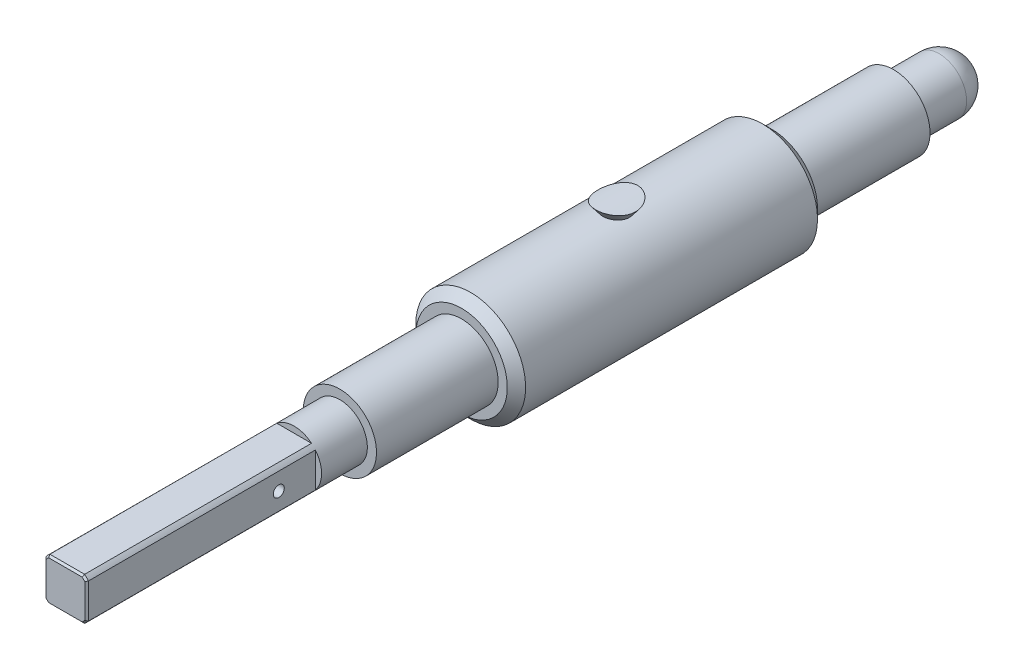
ISO-10303-21;
HEADER;
FILE_DESCRIPTION(('STEP AP214'),'2;1');
FILE_NAME('part.step','',(''),(''),'','','');
FILE_SCHEMA(('AUTOMOTIVE_DESIGN { 1 0 10303 214 1 1 1 1 }'));
ENDSEC;
DATA;
#1=APPLICATION_CONTEXT('core data for automotive mechanical design processes');
#2=APPLICATION_PROTOCOL_DEFINITION('international standard','automotive_design',2000,#1);
#3=PRODUCT_CONTEXT('',#1,'mechanical');
#4=PRODUCT('Part','Part','',(#3));
#5=PRODUCT_RELATED_PRODUCT_CATEGORY('part','',(#4));
#6=PRODUCT_DEFINITION_FORMATION('','',#4);
#7=PRODUCT_DEFINITION_CONTEXT('part definition',#1,'design');
#8=PRODUCT_DEFINITION('design','',#6,#7);
#9=PRODUCT_DEFINITION_SHAPE('','',#8);
#10=(LENGTH_UNIT() NAMED_UNIT(*) SI_UNIT(.MILLI.,.METRE.));
#11=(NAMED_UNIT(*) PLANE_ANGLE_UNIT() SI_UNIT($,.RADIAN.));
#12=(NAMED_UNIT(*) SI_UNIT($,.STERADIAN.) SOLID_ANGLE_UNIT());
#13=UNCERTAINTY_MEASURE_WITH_UNIT(LENGTH_MEASURE(1.E-05),#10,'distance_accuracy_value','');
#14=(GEOMETRIC_REPRESENTATION_CONTEXT(3) GLOBAL_UNCERTAINTY_ASSIGNED_CONTEXT((#13)) GLOBAL_UNIT_ASSIGNED_CONTEXT((#10,
#11,#12)) REPRESENTATION_CONTEXT('',''));
#15=CARTESIAN_POINT('',(0.,0.,0.));
#16=DIRECTION('',(0.,0.,1.));
#17=DIRECTION('',(1.,0.,0.));
#18=AXIS2_PLACEMENT_3D('',#15,#16,#17);
#19=CARTESIAN_POINT('',(0.,-108.5,-65.5));
#20=DIRECTION('',(0.,0.,-1.));
#21=DIRECTION('',(-1.,0.,0.));
#22=AXIS2_PLACEMENT_3D('',#19,#20,#21);
#23=CYLINDRICAL_SURFACE('',#22,5.99999999999999);
#24=CARTESIAN_POINT('',(0.,-108.5,-46.2));
#25=DIRECTION('',(0.,0.,1.));
#26=DIRECTION('',(1.,0.,0.));
#27=AXIS2_PLACEMENT_3D('',#24,#25,#26);
#28=CIRCLE('',#27,5.99999999999999);
#29=CARTESIAN_POINT('',(5.99999999999999,-108.5,-46.2));
#30=VERTEX_POINT('',#29);
#31=EDGE_CURVE('E220',#30,#30,#28,.T.);
#32=ORIENTED_EDGE('',*,*,#31,.T.);
#33=EDGE_LOOP('',(#32));
#34=FACE_BOUND('',#33,.T.);
#35=CARTESIAN_POINT('',(0.,-108.5,-14.3));
#36=DIRECTION('',(0.,0.,-1.));
#37=DIRECTION('',(-1.,0.,0.));
#38=AXIS2_PLACEMENT_3D('',#35,#36,#37);
#39=CIRCLE('',#38,5.99999999999999);
#40=CARTESIAN_POINT('',(-5.99999999999999,-108.5,-14.3));
#41=VERTEX_POINT('',#40);
#42=EDGE_CURVE('E284',#41,#41,#39,.T.);
#43=ORIENTED_EDGE('',*,*,#42,.T.);
#44=EDGE_LOOP('',(#43));
#45=FACE_BOUND('',#44,.T.);
#46=CARTESIAN_POINT('',(-0.82637820474592,-102.557180882551,-31.4907726388026));
#47=CARTESIAN_POINT('',(-0.88745278390253,-102.565673714073,-31.442263246116));
#48=CARTESIAN_POINT('',(-0.944525193709329,-102.574571898779,-31.3887307084372));
#49=CARTESIAN_POINT('',(-1.04961089123308,-102.592278845168,-31.2733383738218));
#50=CARTESIAN_POINT('',(-1.09761204529484,-102.601087472374,-31.2114676104821));
#51=CARTESIAN_POINT('',(-1.18685551918393,-102.618368464541,-31.0764186630549));
#52=CARTESIAN_POINT('',(-1.22736698646508,-102.626771496805,-31.0027479014204));
#53=CARTESIAN_POINT('',(-1.29639767309498,-102.641621113598,-30.8498274009609));
#54=CARTESIAN_POINT('',(-1.32491659444847,-102.648067649511,-30.7705775235612));
#55=CARTESIAN_POINT('',(-1.37086663897318,-102.658654127998,-30.6035291754309));
#56=CARTESIAN_POINT('',(-1.38751561436713,-102.662629450214,-30.5155041042145));
#57=CARTESIAN_POINT('',(-1.40647609896515,-102.667168738239,-30.3378309364648));
#58=CARTESIAN_POINT('',(-1.40878523045451,-102.667732138312,-30.2481825732418));
#59=CARTESIAN_POINT('',(-1.39892903879036,-102.665359932576,-30.0681089716912));
#60=CARTESIAN_POINT('',(-1.38650316947336,-102.662361341542,-29.9776986709831));
#61=CARTESIAN_POINT('',(-1.34698562124341,-102.653117314475,-29.8003016242328));
#62=CARTESIAN_POINT('',(-1.31989242502994,-102.646871542531,-29.7133152333849));
#63=CARTESIAN_POINT('',(-1.25162599544786,-102.631895884138,-29.5454697738345));
#64=CARTESIAN_POINT('',(-1.21048024363986,-102.623170851752,-29.4645991192579));
#65=CARTESIAN_POINT('',(-1.11486338066509,-102.60428579393,-29.3113082366902));
#66=CARTESIAN_POINT('',(-1.06039227283579,-102.594125768854,-29.2388880065824));
#67=CARTESIAN_POINT('',(-0.941083201845459,-102.57396399216,-29.1071312825275));
#68=CARTESIAN_POINT('',(-0.876611968800397,-102.563966860161,-29.0474631863073));
#69=CARTESIAN_POINT('',(-0.737658889157939,-102.545106782895,-28.9409609310564));
#70=CARTESIAN_POINT('',(-0.663183487452894,-102.536243114546,-28.8941185679672));
#71=CARTESIAN_POINT('',(-0.512891805506087,-102.521525512226,-28.8188747513442));
#72=CARTESIAN_POINT('',(-0.437700183019511,-102.515482798018,-28.789265162978));
#73=CARTESIAN_POINT('',(-0.283006333943005,-102.506179163899,-28.7443439612554));
#74=CARTESIAN_POINT('',(-0.203507492786278,-102.502916092006,-28.7290212861913));
#75=CARTESIAN_POINT('',(-0.0505955429153818,-102.499772252239,-28.7142678934116));
#76=CARTESIAN_POINT('',(0.0226825027364362,-102.499600928561,-28.7134719009311));
#77=CARTESIAN_POINT('',(0.168256616551282,-102.50191824034,-28.7243329491502));
#78=CARTESIAN_POINT('',(0.240552859425564,-102.504406396093,-28.7359877440355));
#79=CARTESIAN_POINT('',(0.379936918101601,-102.51164616207,-28.7706550873727));
#80=CARTESIAN_POINT('',(0.447115615263432,-102.516328450556,-28.7933205178987));
#81=CARTESIAN_POINT('',(0.576922973149197,-102.527445348322,-28.8488943896099));
#82=CARTESIAN_POINT('',(0.639550819877732,-102.533880270117,-28.8818046577197));
#83=CARTESIAN_POINT('',(0.762148265627854,-102.548265460455,-28.9586944584824));
#84=CARTESIAN_POINT('',(0.821798218175558,-102.556278219899,-29.0031705233515));
#85=CARTESIAN_POINT('',(0.933512279650743,-102.57279573948,-29.1007148537477));
#86=CARTESIAN_POINT('',(0.985573513144855,-102.581300684415,-29.1537863601677));
#87=CARTESIAN_POINT('',(1.08577183289901,-102.598819881024,-29.2723518922424));
#88=CARTESIAN_POINT('',(1.13308904578969,-102.607807571901,-29.3385430612302));
#89=CARTESIAN_POINT('',(1.21692096063208,-102.624548102523,-29.4775858930471));
#90=CARTESIAN_POINT('',(1.25343179085615,-102.632300499226,-29.5504399308514));
#91=CARTESIAN_POINT('',(1.31744552164147,-102.646325998204,-29.7067540878266));
#92=CARTESIAN_POINT('',(1.34404603877912,-102.652440637395,-29.7905992267105));
#93=CARTESIAN_POINT('',(1.38358850130719,-102.661670015936,-29.9616100382681));
#94=CARTESIAN_POINT('',(1.39652819994176,-102.664784261812,-30.0487762547082));
#95=CARTESIAN_POINT('',(1.4086955451044,-102.667708718895,-30.2269023373845));
#96=CARTESIAN_POINT('',(1.40747583902601,-102.667411140414,-30.3178949082596));
#97=CARTESIAN_POINT('',(1.39025894114319,-102.663283819764,-30.4983962634066));
#98=CARTESIAN_POINT('',(1.37426032283703,-102.659453736629,-30.5879049035962));
#99=CARTESIAN_POINT('',(1.32770718717805,-102.648695616203,-30.7632404618323));
#100=CARTESIAN_POINT('',(1.29709636881104,-102.641755602696,-30.8490517275927));
#101=CARTESIAN_POINT('',(1.22187138536613,-102.625606098346,-31.0140991005353));
#102=CARTESIAN_POINT('',(1.17725590290179,-102.616396394015,-31.0933345882622));
#103=CARTESIAN_POINT('',(1.07569006355021,-102.596991057237,-31.2414878794554));
#104=CARTESIAN_POINT('',(1.01894649992018,-102.5868133726,-31.3105493562402));
#105=CARTESIAN_POINT('',(0.893879362320993,-102.566621841271,-31.4373119009342));
#106=CARTESIAN_POINT('',(0.825559996945611,-102.55660793648,-31.4950170812095));
#107=CARTESIAN_POINT('',(0.683696850524749,-102.538680116792,-31.5932902446544));
#108=CARTESIAN_POINT('',(0.610758695559436,-102.530673326923,-31.6347126241589));
#109=CARTESIAN_POINT('',(0.458269254269458,-102.517039055396,-31.7033201588382));
#110=CARTESIAN_POINT('',(0.378723913179516,-102.511409461875,-31.7305179560572));
#111=CARTESIAN_POINT('',(0.22387427472047,-102.503727585641,-31.7672194423107));
#112=CARTESIAN_POINT('',(0.148937289854291,-102.501374718525,-31.7782163114319));
#113=CARTESIAN_POINT('',(-0.0017391687966094,-102.499528118826,-31.7868663697102));
#114=CARTESIAN_POINT('',(-0.0774784237001038,-102.500033625483,-31.7845231093596));
#115=CARTESIAN_POINT('',(-0.222738568142433,-102.503721601243,-31.767174945591));
#116=CARTESIAN_POINT('',(-0.292358463000509,-102.506740281334,-31.7529445657775));
#117=CARTESIAN_POINT('',(-0.428230256940059,-102.514914594998,-31.7134805200632));
#118=CARTESIAN_POINT('',(-0.494484023249986,-102.520069028989,-31.6882530304586));
#119=CARTESIAN_POINT('',(-0.606043836841092,-102.530492097917,-31.635422601142));
#120=CARTESIAN_POINT('',(-0.652436399173812,-102.535407924918,-31.610001966419));
#121=CARTESIAN_POINT('',(-0.741955113558313,-102.545881057924,-31.554076992841));
#122=CARTESIAN_POINT('',(-0.785081560010341,-102.551438305999,-31.5235731129733));
#123=CARTESIAN_POINT('',(-0.82637820474592,-102.557180882551,-31.4907726388026));
#124=B_SPLINE_CURVE_WITH_KNOTS('',3,(#46,#47,#48,#49,#50,#51,#52,#53,#54,#55,#56,#57,#58,#59,
#60,#61,#62,#63,#64,#65,#66,#67,#68,#69,#70,#71,#72,#73,#74,#75,#76,#77,#78,#79,#80,#81,#82,#83,
#84,#85,#86,#87,#88,#89,#90,#91,#92,#93,#94,#95,#96,#97,#98,#99,#100,#101,#102,#103,#104,#105,
#106,#107,#108,#109,#110,#111,#112,#113,#114,#115,#116,#117,#118,#119,#120,#121,#122,#123),
.UNSPECIFIED.,.T.,.F.,(4,2,2,2,2,2,2,2,2,2,2,2,2,2,2,2,2,2,2,2,2,2,2,2,2,2,2,2,2,2,2,2,2,2,2,2,
2,2,4),(0.,0.235192707713775,0.470697814900819,0.72307958224305,0.975467620490893,
1.24324566640779,1.51106811188776,1.78369770707931,2.05635551055298,2.32848312157081,
2.6006106644316,2.86444091583586,3.12810201025082,3.36987338952953,3.61145742039754,
3.83020580952266,4.04891474850555,4.26113688835574,4.47339689470599,4.69697133824997,
4.92063027715513,5.16516582809959,5.40978888586117,5.67311900794847,5.93649243244573,
6.20820895113386,6.47995169939725,6.75275003298626,7.02557403577868,7.29407224857164,
7.5624730525879,7.81386141405137,8.0650259737544,8.29116117339579,8.51723618968281,
8.72963511210783,8.9419148985146,9.10095891372674,9.25998857596885),.UNSPECIFIED.);
#125=CARTESIAN_POINT('',(-0.82637820474592,-102.557180882551,-31.4907726388026));
#126=VERTEX_POINT('',#125);
#127=EDGE_CURVE('E223',#126,#126,#124,.T.);
#128=ORIENTED_EDGE('',*,*,#127,.F.);
#129=EDGE_LOOP('',(#128));
#130=FACE_BOUND('',#129,.T.);
#131=ADVANCED_FACE('F98',(#34,#45,#130),#23,.T.);
#132=CARTESIAN_POINT('',(0.,-108.5,-65.5));
#133=DIRECTION('',(0.,0.,-1.));
#134=DIRECTION('',(-1.,0.,0.));
#135=AXIS2_PLACEMENT_3D('',#132,#133,#134);
#136=CYLINDRICAL_SURFACE('',#135,3.00000000000001);
#137=CARTESIAN_POINT('',(0.,-108.5,0.));
#138=DIRECTION('',(0.,0.,-1.));
#139=DIRECTION('',(-1.,0.,0.));
#140=AXIS2_PLACEMENT_3D('',#137,#138,#139);
#141=CIRCLE('',#140,3.);
#142=CARTESIAN_POINT('',(-3.,-108.5,0.));
#143=VERTEX_POINT('',#142);
#144=EDGE_CURVE('E271',#143,#143,#141,.T.);
#145=ORIENTED_EDGE('',*,*,#144,.F.);
#146=EDGE_LOOP('',(#145));
#147=FACE_BOUND('',#146,.T.);
#148=DIRECTION('',(0.,0.,-1.));
#149=VECTOR('',#148,1.);
#150=CARTESIAN_POINT('',(-2.32132034355964,-106.599612707216,-65.5));
#151=LINE('',#150,#149);
#152=CARTESIAN_POINT('',(-2.32132034355964,-106.599612707216,29.8));
#153=VERTEX_POINT('',#152);
#154=CARTESIAN_POINT('',(-2.32132034355964,-106.599612707216,5.));
#155=VERTEX_POINT('',#154);
#156=EDGE_CURVE('E256',#153,#155,#151,.T.);
#157=ORIENTED_EDGE('',*,*,#156,.F.);
#158=CARTESIAN_POINT('',(0.,-108.5,29.8));
#159=DIRECTION('',(0.,0.,-1.));
#160=DIRECTION('',(-1.,0.,0.));
#161=AXIS2_PLACEMENT_3D('',#158,#159,#160);
#162=CIRCLE('',#161,3.00000000000001);
#163=CARTESIAN_POINT('',(-1.90038729278436,-106.17867965644,29.8));
#164=VERTEX_POINT('',#163);
#165=EDGE_CURVE('E246',#153,#164,#162,.T.);
#166=ORIENTED_EDGE('',*,*,#165,.T.);
#167=DIRECTION('',(0.,0.,-1.));
#168=VECTOR('',#167,1.);
#169=CARTESIAN_POINT('',(-1.90038729278436,-106.17867965644,-65.5));
#170=LINE('',#169,#168);
#171=CARTESIAN_POINT('',(-1.90038729278436,-106.17867965644,5.));
#172=VERTEX_POINT('',#171);
#173=EDGE_CURVE('E241',#172,#164,#170,.F.);
#174=ORIENTED_EDGE('',*,*,#173,.F.);
#175=CARTESIAN_POINT('',(0.,-108.5,5.));
#176=DIRECTION('',(0.,0.,1.));
#177=DIRECTION('',(1.,0.,0.));
#178=AXIS2_PLACEMENT_3D('',#175,#176,#177);
#179=CIRCLE('',#178,3.00000000000001);
#180=CARTESIAN_POINT('',(1.90038729278436,-106.17867965644,5.));
#181=VERTEX_POINT('',#180);
#182=EDGE_CURVE('E218',#181,#172,#179,.T.);
#183=ORIENTED_EDGE('',*,*,#182,.F.);
#184=DIRECTION('',(0.,0.,-1.));
#185=VECTOR('',#184,1.);
#186=CARTESIAN_POINT('',(1.90038729278436,-106.17867965644,-65.5));
#187=LINE('',#186,#185);
#188=CARTESIAN_POINT('',(1.90038729278436,-106.17867965644,29.8));
#189=VERTEX_POINT('',#188);
#190=EDGE_CURVE('E242',#189,#181,#187,.T.);
#191=ORIENTED_EDGE('',*,*,#190,.F.);
#192=CARTESIAN_POINT('',(0.,-108.5,29.8));
#193=DIRECTION('',(0.,0.,-1.));
#194=DIRECTION('',(-1.,0.,0.));
#195=AXIS2_PLACEMENT_3D('',#192,#193,#194);
#196=CIRCLE('',#195,3.00000000000001);
#197=CARTESIAN_POINT('',(2.32132034355964,-106.599612707216,29.8));
#198=VERTEX_POINT('',#197);
#199=EDGE_CURVE('E583',#189,#198,#196,.T.);
#200=ORIENTED_EDGE('',*,*,#199,.T.);
#201=DIRECTION('',(0.,0.,-1.));
#202=VECTOR('',#201,1.);
#203=CARTESIAN_POINT('',(2.32132034355964,-106.599612707216,-65.5));
#204=LINE('',#203,#202);
#205=CARTESIAN_POINT('',(2.32132034355964,-106.599612707216,5.));
#206=VERTEX_POINT('',#205);
#207=EDGE_CURVE('E203',#206,#198,#204,.F.);
#208=ORIENTED_EDGE('',*,*,#207,.F.);
#209=CARTESIAN_POINT('',(2.32132034355964,-110.400387292784,5.));
#210=VERTEX_POINT('',#209);
#211=EDGE_CURVE('E214',#210,#206,#179,.T.);
#212=ORIENTED_EDGE('',*,*,#211,.F.);
#213=DIRECTION('',(0.,0.,-1.));
#214=VECTOR('',#213,1.);
#215=CARTESIAN_POINT('',(2.32132034355964,-110.400387292784,-65.5));
#216=LINE('',#215,#214);
#217=CARTESIAN_POINT('',(2.32132034355964,-110.400387292784,29.8));
#218=VERTEX_POINT('',#217);
#219=EDGE_CURVE('E247',#218,#210,#216,.T.);
#220=ORIENTED_EDGE('',*,*,#219,.F.);
#221=CARTESIAN_POINT('',(0.,-108.5,29.8));
#222=DIRECTION('',(0.,0.,-1.));
#223=DIRECTION('',(-1.,0.,0.));
#224=AXIS2_PLACEMENT_3D('',#221,#222,#223);
#225=CIRCLE('',#224,3.00000000000001);
#226=CARTESIAN_POINT('',(1.90038729278431,-110.82132034356,29.8));
#227=VERTEX_POINT('',#226);
#228=EDGE_CURVE('E582',#218,#227,#225,.T.);
#229=ORIENTED_EDGE('',*,*,#228,.T.);
#230=DIRECTION('',(0.,0.,-1.));
#231=VECTOR('',#230,1.);
#232=CARTESIAN_POINT('',(1.90038729278431,-110.82132034356,-65.5));
#233=LINE('',#232,#231);
#234=CARTESIAN_POINT('',(1.90038729278431,-110.82132034356,5.));
#235=VERTEX_POINT('',#234);
#236=EDGE_CURVE('E204',#235,#227,#233,.F.);
#237=ORIENTED_EDGE('',*,*,#236,.F.);
#238=CARTESIAN_POINT('',(-1.90038729278431,-110.82132034356,5.));
#239=VERTEX_POINT('',#238);
#240=EDGE_CURVE('E208',#239,#235,#179,.T.);
#241=ORIENTED_EDGE('',*,*,#240,.F.);
#242=DIRECTION('',(0.,0.,-1.));
#243=VECTOR('',#242,1.);
#244=CARTESIAN_POINT('',(-1.90038729278431,-110.82132034356,-65.5));
#245=LINE('',#244,#243);
#246=CARTESIAN_POINT('',(-1.90038729278431,-110.82132034356,29.8));
#247=VERTEX_POINT('',#246);
#248=EDGE_CURVE('E193',#247,#239,#245,.T.);
#249=ORIENTED_EDGE('',*,*,#248,.F.);
#250=CARTESIAN_POINT('',(0.,-108.5,29.8));
#251=DIRECTION('',(0.,0.,-1.));
#252=DIRECTION('',(-1.,0.,0.));
#253=AXIS2_PLACEMENT_3D('',#250,#251,#252);
#254=CIRCLE('',#253,3.00000000000001);
#255=CARTESIAN_POINT('',(-2.32132034355964,-110.400387292784,29.8));
#256=VERTEX_POINT('',#255);
#257=EDGE_CURVE('E229',#247,#256,#254,.T.);
#258=ORIENTED_EDGE('',*,*,#257,.T.);
#259=DIRECTION('',(0.,0.,-1.));
#260=VECTOR('',#259,1.);
#261=CARTESIAN_POINT('',(-2.32132034355964,-110.400387292784,-65.5));
#262=LINE('',#261,#260);
#263=CARTESIAN_POINT('',(-2.32132034355964,-110.400387292784,5.));
#264=VERTEX_POINT('',#263);
#265=EDGE_CURVE('E249',#264,#256,#262,.F.);
#266=ORIENTED_EDGE('',*,*,#265,.F.);
#267=EDGE_CURVE('E217',#155,#264,#179,.T.);
#268=ORIENTED_EDGE('',*,*,#267,.F.);
#269=EDGE_LOOP('',(#157,#166,#174,#183,#191,#200,#208,#212,#220,#229,#237,#241,#249,#258,#266,#268));
#270=FACE_BOUND('',#269,.T.);
#271=ADVANCED_FACE('F213',(#147,#270),#136,.T.);
#272=CARTESIAN_POINT('',(0.,-108.5,30.));
#273=DIRECTION('',(0.,0.,-1.));
#274=DIRECTION('',(-1.,0.,0.));
#275=AXIS2_PLACEMENT_3D('',#272,#273,#274);
#276=PLANE('',#275);
#277=DIRECTION('',(-1.,0.,0.));
#278=VECTOR('',#277,1.);
#279=CARTESIAN_POINT('',(-1.90038729278437,-106.37867965644,30.));
#280=LINE('',#279,#278);
#281=CARTESIAN_POINT('',(1.82756668824975,-106.37867965644,30.));
#282=VERTEX_POINT('',#281);
#283=CARTESIAN_POINT('',(-1.82756668824974,-106.37867965644,30.));
#284=VERTEX_POINT('',#283);
#285=EDGE_CURVE('E120',#282,#284,#280,.T.);
#286=ORIENTED_EDGE('',*,*,#285,.T.);
#287=CARTESIAN_POINT('',(0.,-108.5,30.));
#288=DIRECTION('',(0.,0.,-1.));
#289=DIRECTION('',(-1.,0.,0.));
#290=AXIS2_PLACEMENT_3D('',#287,#288,#289);
#291=CIRCLE('',#290,2.8);
#292=CARTESIAN_POINT('',(-2.12132034355963,-106.67243331175,30.));
#293=VERTEX_POINT('',#292);
#294=EDGE_CURVE('E567',#284,#293,#291,.F.);
#295=ORIENTED_EDGE('',*,*,#294,.T.);
#296=DIRECTION('',(0.,-1.,0.));
#297=VECTOR('',#296,1.);
#298=CARTESIAN_POINT('',(-2.12132034355963,-110.400387292784,30.));
#299=LINE('',#298,#297);
#300=CARTESIAN_POINT('',(-2.12132034355963,-110.32756668825,30.));
#301=VERTEX_POINT('',#300);
#302=EDGE_CURVE('E560',#293,#301,#299,.T.);
#303=ORIENTED_EDGE('',*,*,#302,.T.);
#304=CARTESIAN_POINT('',(0.,-108.5,30.));
#305=DIRECTION('',(0.,0.,-1.));
#306=DIRECTION('',(-1.,0.,0.));
#307=AXIS2_PLACEMENT_3D('',#304,#305,#306);
#308=CIRCLE('',#307,2.8);
#309=CARTESIAN_POINT('',(-1.82756668824969,-110.62132034356,30.));
#310=VERTEX_POINT('',#309);
#311=EDGE_CURVE('E550',#301,#310,#308,.F.);
#312=ORIENTED_EDGE('',*,*,#311,.T.);
#313=DIRECTION('',(1.,0.,0.));
#314=VECTOR('',#313,1.);
#315=CARTESIAN_POINT('',(1.90038729278432,-110.62132034356,30.));
#316=LINE('',#315,#314);
#317=CARTESIAN_POINT('',(1.8275666882497,-110.62132034356,30.));
#318=VERTEX_POINT('',#317);
#319=EDGE_CURVE('E553',#310,#318,#316,.T.);
#320=ORIENTED_EDGE('',*,*,#319,.T.);
#321=CARTESIAN_POINT('',(0.,-108.5,30.));
#322=DIRECTION('',(0.,0.,-1.));
#323=DIRECTION('',(-1.,0.,0.));
#324=AXIS2_PLACEMENT_3D('',#321,#322,#323);
#325=CIRCLE('',#324,2.80000000000001);
#326=CARTESIAN_POINT('',(2.12132034355963,-110.32756668825,30.));
#327=VERTEX_POINT('',#326);
#328=EDGE_CURVE('E556',#318,#327,#325,.F.);
#329=ORIENTED_EDGE('',*,*,#328,.T.);
#330=DIRECTION('',(0.,1.,0.));
#331=VECTOR('',#330,1.);
#332=CARTESIAN_POINT('',(2.12132034355964,-106.599612707216,30.));
#333=LINE('',#332,#331);
#334=CARTESIAN_POINT('',(2.12132034355964,-106.67243331175,30.));
#335=VERTEX_POINT('',#334);
#336=EDGE_CURVE('E558',#327,#335,#333,.T.);
#337=ORIENTED_EDGE('',*,*,#336,.T.);
#338=CARTESIAN_POINT('',(0.,-108.5,30.));
#339=DIRECTION('',(0.,0.,-1.));
#340=DIRECTION('',(-1.,0.,0.));
#341=AXIS2_PLACEMENT_3D('',#338,#339,#340);
#342=CIRCLE('',#341,2.80000000000001);
#343=EDGE_CURVE('E125',#335,#282,#342,.F.);
#344=ORIENTED_EDGE('',*,*,#343,.T.);
#345=EDGE_LOOP('',(#286,#295,#303,#312,#320,#329,#337,#344));
#346=FACE_BOUND('',#345,.T.);
#347=ADVANCED_FACE('F305',(#346),#276,.F.);
#348=CARTESIAN_POINT('',(0.,-114.5,-47.2));
#349=DIRECTION('',(0.,0.,1.));
#350=DIRECTION('',(1.,0.,0.));
#351=AXIS2_PLACEMENT_3D('',#348,#349,#350);
#352=PLANE('',#351);
#353=CARTESIAN_POINT('',(0.,-108.5,-47.2));
#354=DIRECTION('',(0.,0.,1.));
#355=DIRECTION('',(1.,0.,0.));
#356=AXIS2_PLACEMENT_3D('',#353,#354,#355);
#357=CIRCLE('',#356,5.00000000000001);
#358=CARTESIAN_POINT('',(5.00000000000001,-108.5,-47.2));
#359=VERTEX_POINT('',#358);
#360=EDGE_CURVE('E280',#359,#359,#357,.F.);
#361=ORIENTED_EDGE('',*,*,#360,.T.);
#362=EDGE_LOOP('',(#361));
#363=FACE_BOUND('',#362,.T.);
#364=CARTESIAN_POINT('',(0.,-108.5,-47.2));
#365=DIRECTION('',(0.,0.,-1.));
#366=DIRECTION('',(-1.,0.,0.));
#367=AXIS2_PLACEMENT_3D('',#364,#365,#366);
#368=CIRCLE('',#367,4.);
#369=CARTESIAN_POINT('',(-4.,-108.5,-47.2));
#370=VERTEX_POINT('',#369);
#371=EDGE_CURVE('E258',#370,#370,#368,.T.);
#372=ORIENTED_EDGE('',*,*,#371,.F.);
#373=EDGE_LOOP('',(#372));
#374=FACE_BOUND('',#373,.T.);
#375=ADVANCED_FACE('F301',(#363,#374),#352,.F.);
#376=CARTESIAN_POINT('',(0.,-112.5,-13.3));
#377=DIRECTION('',(0.,0.,-1.));
#378=DIRECTION('',(-1.,0.,0.));
#379=AXIS2_PLACEMENT_3D('',#376,#377,#378);
#380=PLANE('',#379);
#381=CARTESIAN_POINT('',(0.,-108.5,-13.3));
#382=DIRECTION('',(0.,0.,-1.));
#383=DIRECTION('',(-1.,0.,0.));
#384=AXIS2_PLACEMENT_3D('',#381,#382,#383);
#385=CIRCLE('',#384,4.99999999999997);
#386=CARTESIAN_POINT('',(-4.99999999999997,-108.5,-13.3));
#387=VERTEX_POINT('',#386);
#388=EDGE_CURVE('E215',#387,#387,#385,.F.);
#389=ORIENTED_EDGE('',*,*,#388,.T.);
#390=EDGE_LOOP('',(#389));
#391=FACE_BOUND('',#390,.T.);
#392=CARTESIAN_POINT('',(0.,-108.5,-13.3));
#393=DIRECTION('',(0.,0.,-1.));
#394=DIRECTION('',(-1.,0.,0.));
#395=AXIS2_PLACEMENT_3D('',#392,#393,#394);
#396=CIRCLE('',#395,4.);
#397=CARTESIAN_POINT('',(-4.,-108.5,-13.3));
#398=VERTEX_POINT('',#397);
#399=EDGE_CURVE('E277',#398,#398,#396,.T.);
#400=ORIENTED_EDGE('',*,*,#399,.T.);
#401=EDGE_LOOP('',(#400));
#402=FACE_BOUND('',#401,.T.);
#403=ADVANCED_FACE('F304',(#391,#402),#380,.F.);
#404=CARTESIAN_POINT('',(0.,-108.5,-65.5));
#405=DIRECTION('',(0.,0.,-1.));
#406=DIRECTION('',(-1.,0.,0.));
#407=AXIS2_PLACEMENT_3D('',#404,#405,#406);
#408=CYLINDRICAL_SURFACE('',#407,4.);
#409=ORIENTED_EDGE('',*,*,#399,.F.);
#410=EDGE_LOOP('',(#409));
#411=FACE_BOUND('',#410,.T.);
#412=CARTESIAN_POINT('',(0.,-108.5,0.));
#413=DIRECTION('',(0.,0.,-1.));
#414=DIRECTION('',(-1.,0.,0.));
#415=AXIS2_PLACEMENT_3D('',#412,#413,#414);
#416=CIRCLE('',#415,4.);
#417=CARTESIAN_POINT('',(-4.,-108.5,0.));
#418=VERTEX_POINT('',#417);
#419=EDGE_CURVE('E274',#418,#418,#416,.T.);
#420=ORIENTED_EDGE('',*,*,#419,.T.);
#421=EDGE_LOOP('',(#420));
#422=FACE_BOUND('',#421,.T.);
#423=ADVANCED_FACE('F628',(#411,#422),#408,.T.);
#424=CARTESIAN_POINT('',(0.,-111.5,0.));
#425=DIRECTION('',(0.,0.,-1.));
#426=DIRECTION('',(-1.,0.,0.));
#427=AXIS2_PLACEMENT_3D('',#424,#425,#426);
#428=PLANE('',#427);
#429=ORIENTED_EDGE('',*,*,#419,.F.);
#430=EDGE_LOOP('',(#429));
#431=FACE_BOUND('',#430,.T.);
#432=ORIENTED_EDGE('',*,*,#144,.T.);
#433=EDGE_LOOP('',(#432));
#434=FACE_BOUND('',#433,.T.);
#435=ADVANCED_FACE('F623',(#431,#434),#428,.F.);
#436=CARTESIAN_POINT('',(0.,-108.5,-65.5));
#437=DIRECTION('',(0.,0.,1.));
#438=DIRECTION('',(1.,0.,0.));
#439=AXIS2_PLACEMENT_3D('',#436,#437,#438);
#440=SPHERICAL_SURFACE('',#439,3.);
#441=CARTESIAN_POINT('',(0.,-108.5,-65.5));
#442=DIRECTION('',(0.,0.,-1.));
#443=DIRECTION('',(-1.,0.,0.));
#444=AXIS2_PLACEMENT_3D('',#441,#442,#443);
#445=CIRCLE('',#444,3.);
#446=CARTESIAN_POINT('',(-3.,-108.5,-65.5));
#447=VERTEX_POINT('',#446);
#448=EDGE_CURVE('E270',#447,#447,#445,.T.);
#449=ORIENTED_EDGE('',*,*,#448,.T.);
#450=EDGE_LOOP('',(#449));
#451=FACE_BOUND('',#450,.T.);
#452=ADVANCED_FACE('F613',(#451),#440,.T.);
#453=CARTESIAN_POINT('',(0.,-108.5,-65.5));
#454=DIRECTION('',(0.,0.,-1.));
#455=DIRECTION('',(-1.,0.,0.));
#456=AXIS2_PLACEMENT_3D('',#453,#454,#455);
#457=CYLINDRICAL_SURFACE('',#456,3.);
#458=ORIENTED_EDGE('',*,*,#448,.F.);
#459=EDGE_LOOP('',(#458));
#460=FACE_BOUND('',#459,.T.);
#461=CARTESIAN_POINT('',(0.,-108.5,-60.5));
#462=DIRECTION('',(0.,0.,-1.));
#463=DIRECTION('',(-1.,0.,0.));
#464=AXIS2_PLACEMENT_3D('',#461,#462,#463);
#465=CIRCLE('',#464,3.);
#466=CARTESIAN_POINT('',(-3.,-108.5,-60.5));
#467=VERTEX_POINT('',#466);
#468=EDGE_CURVE('E266',#467,#467,#465,.T.);
#469=ORIENTED_EDGE('',*,*,#468,.T.);
#470=EDGE_LOOP('',(#469));
#471=FACE_BOUND('',#470,.T.);
#472=ADVANCED_FACE('F316',(#460,#471),#457,.T.);
#473=CARTESIAN_POINT('',(0.,-112.5,-60.5));
#474=DIRECTION('',(0.,0.,1.));
#475=DIRECTION('',(1.,0.,0.));
#476=AXIS2_PLACEMENT_3D('',#473,#474,#475);
#477=PLANE('',#476);
#478=ORIENTED_EDGE('',*,*,#468,.F.);
#479=EDGE_LOOP('',(#478));
#480=FACE_BOUND('',#479,.T.);
#481=CARTESIAN_POINT('',(0.,-108.5,-60.5));
#482=DIRECTION('',(0.,0.,-1.));
#483=DIRECTION('',(-1.,0.,0.));
#484=AXIS2_PLACEMENT_3D('',#481,#482,#483);
#485=CIRCLE('',#484,4.);
#486=CARTESIAN_POINT('',(-4.,-108.5,-60.5));
#487=VERTEX_POINT('',#486);
#488=EDGE_CURVE('E262',#487,#487,#485,.T.);
#489=ORIENTED_EDGE('',*,*,#488,.T.);
#490=EDGE_LOOP('',(#489));
#491=FACE_BOUND('',#490,.T.);
#492=ADVANCED_FACE('F310',(#480,#491),#477,.F.);
#493=CARTESIAN_POINT('',(0.,-108.5,-65.5));
#494=DIRECTION('',(0.,0.,-1.));
#495=DIRECTION('',(-1.,0.,0.));
#496=AXIS2_PLACEMENT_3D('',#493,#494,#495);
#497=CYLINDRICAL_SURFACE('',#496,4.);
#498=ORIENTED_EDGE('',*,*,#488,.F.);
#499=EDGE_LOOP('',(#498));
#500=FACE_BOUND('',#499,.T.);
#501=ORIENTED_EDGE('',*,*,#371,.T.);
#502=EDGE_LOOP('',(#501));
#503=FACE_BOUND('',#502,.T.);
#504=ADVANCED_FACE('F297',(#500,#503),#497,.T.);
#505=CARTESIAN_POINT('',(0.,-108.5,-47.2));
#506=DIRECTION('',(0.,0.,1.));
#507=DIRECTION('',(1.,0.,0.));
#508=AXIS2_PLACEMENT_3D('',#505,#506,#507);
#509=CONICAL_SURFACE('',#508,5.00000000000001,0.785398163397438);
#510=ORIENTED_EDGE('',*,*,#31,.F.);
#511=EDGE_LOOP('',(#510));
#512=FACE_BOUND('',#511,.T.);
#513=ORIENTED_EDGE('',*,*,#360,.F.);
#514=EDGE_LOOP('',(#513));
#515=FACE_BOUND('',#514,.T.);
#516=ADVANCED_FACE('F293',(#512,#515),#509,.T.);
#517=CARTESIAN_POINT('',(0.,-108.5,-14.3));
#518=DIRECTION('',(0.,0.,-1.));
#519=DIRECTION('',(-1.,0.,0.));
#520=AXIS2_PLACEMENT_3D('',#517,#518,#519);
#521=CONICAL_SURFACE('',#520,5.99999999999999,0.785398163397456);
#522=ORIENTED_EDGE('',*,*,#388,.F.);
#523=EDGE_LOOP('',(#522));
#524=FACE_BOUND('',#523,.T.);
#525=ORIENTED_EDGE('',*,*,#42,.F.);
#526=EDGE_LOOP('',(#525));
#527=FACE_BOUND('',#526,.T.);
#528=ADVANCED_FACE('F296',(#524,#527),#521,.T.);
#529=CARTESIAN_POINT('',(-2.32132034355964,-110.82132034356,5.));
#530=DIRECTION('',(0.,-1.,0.));
#531=DIRECTION('',(0.,0.,-1.));
#532=AXIS2_PLACEMENT_3D('',#529,#530,#531);
#533=PLANE('',#532);
#534=ORIENTED_EDGE('',*,*,#236,.T.);
#535=DIRECTION('',(-1.,0.,0.));
#536=VECTOR('',#535,1.);
#537=CARTESIAN_POINT('',(-1.90038729278432,-110.82132034356,29.8));
#538=LINE('',#537,#536);
#539=EDGE_CURVE('E112',#227,#247,#538,.T.);
#540=ORIENTED_EDGE('',*,*,#539,.T.);
#541=ORIENTED_EDGE('',*,*,#248,.T.);
#542=DIRECTION('',(1.,0.,0.));
#543=VECTOR('',#542,1.);
#544=CARTESIAN_POINT('',(-2.32132034355964,-110.82132034356,5.));
#545=LINE('',#544,#543);
#546=EDGE_CURVE('E197',#239,#235,#545,.T.);
#547=ORIENTED_EDGE('',*,*,#546,.T.);
#548=EDGE_LOOP('',(#534,#540,#541,#547));
#549=FACE_BOUND('',#548,.T.);
#550=ADVANCED_FACE('F196',(#549),#533,.T.);
#551=CARTESIAN_POINT('',(0.,-108.5,5.));
#552=DIRECTION('',(0.,0.,1.));
#553=DIRECTION('',(1.,0.,0.));
#554=AXIS2_PLACEMENT_3D('',#551,#552,#553);
#555=PLANE('',#554);
#556=ORIENTED_EDGE('',*,*,#240,.T.);
#557=ORIENTED_EDGE('',*,*,#546,.F.);
#558=EDGE_LOOP('',(#556,#557));
#559=FACE_BOUND('',#558,.T.);
#560=ADVANCED_FACE('F207',(#559),#555,.T.);
#561=CARTESIAN_POINT('',(2.32132034355964,-106.17867965644,5.));
#562=DIRECTION('',(1.,0.,0.));
#563=DIRECTION('',(0.,1.,0.));
#564=AXIS2_PLACEMENT_3D('',#561,#562,#563);
#565=PLANE('',#564);
#566=CARTESIAN_POINT('',(2.32132034355964,-108.5,9.));
#567=DIRECTION('',(1.,0.,0.));
#568=DIRECTION('',(0.,1.,0.));
#569=AXIS2_PLACEMENT_3D('',#566,#567,#568);
#570=CIRCLE('',#569,0.600000000000008);
#571=CARTESIAN_POINT('',(2.32132034355964,-107.9,9.));
#572=VERTEX_POINT('',#571);
#573=EDGE_CURVE('E596',#572,#572,#570,.T.);
#574=ORIENTED_EDGE('',*,*,#573,.F.);
#575=EDGE_LOOP('',(#574));
#576=FACE_BOUND('',#575,.T.);
#577=ORIENTED_EDGE('',*,*,#207,.T.);
#578=DIRECTION('',(0.,-1.,0.));
#579=VECTOR('',#578,1.);
#580=CARTESIAN_POINT('',(2.32132034355964,-110.400387292784,29.8));
#581=LINE('',#580,#579);
#582=EDGE_CURVE('E571',#198,#218,#581,.T.);
#583=ORIENTED_EDGE('',*,*,#582,.T.);
#584=ORIENTED_EDGE('',*,*,#219,.T.);
#585=DIRECTION('',(0.,1.,0.));
#586=VECTOR('',#585,1.);
#587=CARTESIAN_POINT('',(2.32132034355964,-106.17867965644,5.));
#588=LINE('',#587,#586);
#589=EDGE_CURVE('E209',#210,#206,#588,.T.);
#590=ORIENTED_EDGE('',*,*,#589,.T.);
#591=EDGE_LOOP('',(#577,#583,#584,#590));
#592=FACE_BOUND('',#591,.T.);
#593=ADVANCED_FACE('F355',(#576,#592),#565,.T.);
#594=ORIENTED_EDGE('',*,*,#211,.T.);
#595=ORIENTED_EDGE('',*,*,#589,.F.);
#596=EDGE_LOOP('',(#594,#595));
#597=FACE_BOUND('',#596,.T.);
#598=ADVANCED_FACE('F354',(#597),#555,.T.);
#599=CARTESIAN_POINT('',(-2.32132034355964,-106.17867965644,5.));
#600=DIRECTION('',(0.,1.,0.));
#601=DIRECTION('',(0.,0.,1.));
#602=AXIS2_PLACEMENT_3D('',#599,#600,#601);
#603=PLANE('',#602);
#604=ORIENTED_EDGE('',*,*,#173,.T.);
#605=DIRECTION('',(1.,0.,0.));
#606=VECTOR('',#605,1.);
#607=CARTESIAN_POINT('',(1.90038729278437,-106.17867965644,29.8));
#608=LINE('',#607,#606);
#609=EDGE_CURVE('E569',#164,#189,#608,.T.);
#610=ORIENTED_EDGE('',*,*,#609,.T.);
#611=ORIENTED_EDGE('',*,*,#190,.T.);
#612=DIRECTION('',(-1.,0.,0.));
#613=VECTOR('',#612,1.);
#614=CARTESIAN_POINT('',(-2.32132034355964,-106.17867965644,5.));
#615=LINE('',#614,#613);
#616=EDGE_CURVE('E235',#181,#172,#615,.T.);
#617=ORIENTED_EDGE('',*,*,#616,.T.);
#618=EDGE_LOOP('',(#604,#610,#611,#617));
#619=FACE_BOUND('',#618,.T.);
#620=ADVANCED_FACE('F240',(#619),#603,.T.);
#621=ORIENTED_EDGE('',*,*,#182,.T.);
#622=ORIENTED_EDGE('',*,*,#616,.F.);
#623=EDGE_LOOP('',(#621,#622));
#624=FACE_BOUND('',#623,.T.);
#625=ADVANCED_FACE('F234',(#624),#555,.T.);
#626=ORIENTED_EDGE('',*,*,#267,.T.);
#627=DIRECTION('',(0.,-1.,0.));
#628=VECTOR('',#627,1.);
#629=CARTESIAN_POINT('',(-2.32132034355964,-106.17867965644,5.));
#630=LINE('',#629,#628);
#631=EDGE_CURVE('E210',#155,#264,#630,.T.);
#632=ORIENTED_EDGE('',*,*,#631,.F.);
#633=EDGE_LOOP('',(#626,#632));
#634=FACE_BOUND('',#633,.T.);
#635=ADVANCED_FACE('F362',(#634),#555,.T.);
#636=CARTESIAN_POINT('',(-2.32132034355964,-106.17867965644,5.));
#637=DIRECTION('',(-1.,0.,0.));
#638=DIRECTION('',(0.,-1.,0.));
#639=AXIS2_PLACEMENT_3D('',#636,#637,#638);
#640=PLANE('',#639);
#641=CARTESIAN_POINT('',(-2.32132034355964,-108.5,9.));
#642=DIRECTION('',(-1.,0.,0.));
#643=DIRECTION('',(0.,-1.,0.));
#644=AXIS2_PLACEMENT_3D('',#641,#642,#643);
#645=CIRCLE('',#644,0.600000000000008);
#646=CARTESIAN_POINT('',(-2.32132034355964,-109.1,9.));
#647=VERTEX_POINT('',#646);
#648=EDGE_CURVE('E545',#647,#647,#645,.T.);
#649=ORIENTED_EDGE('',*,*,#648,.F.);
#650=EDGE_LOOP('',(#649));
#651=FACE_BOUND('',#650,.T.);
#652=ORIENTED_EDGE('',*,*,#265,.T.);
#653=DIRECTION('',(0.,1.,0.));
#654=VECTOR('',#653,1.);
#655=CARTESIAN_POINT('',(-2.32132034355964,-106.599612707216,29.8));
#656=LINE('',#655,#654);
#657=EDGE_CURVE('E53',#256,#153,#656,.T.);
#658=ORIENTED_EDGE('',*,*,#657,.T.);
#659=ORIENTED_EDGE('',*,*,#156,.T.);
#660=ORIENTED_EDGE('',*,*,#631,.T.);
#661=EDGE_LOOP('',(#652,#658,#659,#660));
#662=FACE_BOUND('',#661,.T.);
#663=ADVANCED_FACE('F347',(#651,#662),#640,.T.);
#664=CARTESIAN_POINT('',(0.,-104.5,-30.25));
#665=DIRECTION('',(0.,1.,0.));
#666=DIRECTION('',(-1.,0.,0.));
#667=AXIS2_PLACEMENT_3D('',#664,#665,#666);
#668=CONICAL_SURFACE('',#667,0.,0.654498469497876);
#669=CARTESIAN_POINT('',(-1.1228233427305,-101.590639025965,-32.1795119173321));
#670=CARTESIAN_POINT('',(-1.02802861450746,-101.575235197509,-32.2483504087034));
#671=CARTESIAN_POINT('',(-0.927223622374403,-101.560863382061,-32.3091929440867));
#672=CARTESIAN_POINT('',(-0.715945340103063,-101.535899734869,-32.4119793391269));
#673=CARTESIAN_POINT('',(-0.605478613265962,-101.525305361534,-32.4539359109153));
#674=CARTESIAN_POINT('',(-0.385805060299346,-101.509831098357,-32.5144366085495));
#675=CARTESIAN_POINT('',(-0.2769995215021,-101.504619152231,-32.5343475393133));
#676=CARTESIAN_POINT('',(-0.0574717770916841,-101.499376811782,-32.5543745444334));
#677=CARTESIAN_POINT('',(0.0532494813421144,-101.499343926111,-32.5545001363823));
#678=CARTESIAN_POINT('',(0.263442409695592,-101.504235541372,-32.5358128567192));
#679=CARTESIAN_POINT('',(0.36307190676152,-101.508739933871,-32.5186049052666));
#680=CARTESIAN_POINT('',(0.558027412359829,-101.521593783561,-32.468516746019));
#681=CARTESIAN_POINT('',(0.653353194395005,-101.529943442866,-32.4356357144265));
#682=CARTESIAN_POINT('',(0.839466091032683,-101.549873541747,-32.3547915338434));
#683=CARTESIAN_POINT('',(0.930109476383416,-101.561520273868,-32.3065160322013));
#684=CARTESIAN_POINT('',(1.10284418539053,-101.586869732331,-32.1969926667214));
#685=CARTESIAN_POINT('',(1.18493245443152,-101.600573188798,-32.1357401929526));
#686=CARTESIAN_POINT('',(1.34747357157785,-101.63036768414,-31.9951261952299));
#687=CARTESIAN_POINT('',(1.42684510750064,-101.646558219209,-31.9145372642635));
#688=CARTESIAN_POINT('',(1.57256173798914,-101.67851733543,-31.7422690924089));
#689=CARTESIAN_POINT('',(1.63890029565737,-101.694285701431,-31.6505843232921));
#690=CARTESIAN_POINT('',(1.76472046778137,-101.725750386045,-31.4471303647983));
#691=CARTESIAN_POINT('',(1.82249241938788,-101.741222540958,-31.3342663278073));
#692=CARTESIAN_POINT('',(1.91996970745719,-101.768263116203,-31.1005497742915));
#693=CARTESIAN_POINT('',(1.95966960244478,-101.7798303605,-30.979694864252));
#694=CARTESIAN_POINT('',(2.02234680654439,-101.798412981698,-30.7250353942528));
#695=CARTESIAN_POINT('',(2.04408216076244,-101.805087142271,-30.5908981500989));
#696=CARTESIAN_POINT('',(2.06596143984357,-101.811806280953,-30.3207113468057));
#697=CARTESIAN_POINT('',(2.06610383308829,-101.811850788812,-30.1846616526981));
#698=CARTESIAN_POINT('',(2.04467516236722,-101.805268502955,-29.9129115598915));
#699=CARTESIAN_POINT('',(2.0228619909718,-101.7985673234,-29.7772319674877));
#700=CARTESIAN_POINT('',(1.95757152575279,-101.779206742027,-29.5116073260423));
#701=CARTESIAN_POINT('',(1.91409072581362,-101.76654637595,-29.3816632087838));
#702=CARTESIAN_POINT('',(1.80627943768561,-101.736830125134,-29.1314037634247));
#703=CARTESIAN_POINT('',(1.74196910734786,-101.719778493315,-29.0110792657095));
#704=CARTESIAN_POINT('',(1.59350475452358,-101.683361055989,-28.7836679076422));
#705=CARTESIAN_POINT('',(1.50934911181126,-101.663995061595,-28.6765821292242));
#706=CARTESIAN_POINT('',(1.32580639384841,-101.626085008797,-28.4830038022215));
#707=CARTESIAN_POINT('',(1.22702560549012,-101.607535185364,-28.3959405359321));
#708=CARTESIAN_POINT('',(1.01440672650335,-101.573058849772,-28.2419791343112));
#709=CARTESIAN_POINT('',(0.900583660908882,-101.557129755072,-28.1750610926635));
#710=CARTESIAN_POINT('',(0.674349961154553,-101.531732357586,-28.0713465524452));
#711=CARTESIAN_POINT('',(0.56314291742151,-101.5217484178,-28.0320584052321));
#712=CARTESIAN_POINT('',(0.335024922767373,-101.507092193662,-27.9750052753642));
#713=CARTESIAN_POINT('',(0.218119931590657,-101.502414478563,-27.9572182857469));
#714=CARTESIAN_POINT('',(-0.00282986858874759,-101.499234172036,-27.9451014485087));
#715=CARTESIAN_POINT('',(-0.106732080536495,-101.500057132328,-27.9482098666088));
#716=CARTESIAN_POINT('',(-0.31239553240268,-101.506218129531,-27.9717810859341));
#717=CARTESIAN_POINT('',(-0.414157048420431,-101.511555580472,-27.9922416349047));
#718=CARTESIAN_POINT('',(-0.610020631720793,-101.525956608018,-28.0486868188967));
#719=CARTESIAN_POINT('',(-0.704254034096515,-101.534918008317,-28.0842469991024));
#720=CARTESIAN_POINT('',(-0.885866717561009,-101.555678122276,-28.1692593758124));
#721=CARTESIAN_POINT('',(-0.973244362179415,-101.567477510647,-28.2187148763042));
#722=CARTESIAN_POINT('',(-1.14611761953359,-101.593868314264,-28.3341125256319));
#723=CARTESIAN_POINT('',(-1.23092918059781,-101.608606064197,-28.4010429260824));
#724=CARTESIAN_POINT('',(-1.38946955013914,-101.63881197804,-28.5467901524067));
#725=CARTESIAN_POINT('',(-1.4631930617122,-101.654280486435,-28.6256126234875));
#726=CARTESIAN_POINT('',(-1.60688310801718,-101.686484343348,-28.803236851184));
#727=CARTESIAN_POINT('',(-1.67530570041448,-101.703145361288,-28.9033024612667));
#728=CARTESIAN_POINT('',(-1.79616177731011,-101.734077874432,-29.1130029238923));
#729=CARTESIAN_POINT('',(-1.8485884581479,-101.748348351688,-29.2226418228841));
#730=CARTESIAN_POINT('',(-1.94077039922911,-101.774234240091,-29.459162282439));
#731=CARTESIAN_POINT('',(-1.97893839577071,-101.785489861887,-29.5867050031529));
#732=CARTESIAN_POINT('',(-2.03474635850576,-101.802189879576,-29.8465687679953));
#733=CARTESIAN_POINT('',(-2.05238408788878,-101.807633642251,-29.9788903311685));
#734=CARTESIAN_POINT('',(-2.06700703215377,-101.812134022237,-30.2485365826151));
#735=CARTESIAN_POINT('',(-2.06339626543037,-101.811006330727,-30.3858971821875));
#736=CARTESIAN_POINT('',(-2.03418948854328,-101.802067546412,-30.6580629607462));
#737=CARTESIAN_POINT('',(-2.00858905549499,-101.794255109074,-30.792867620069));
#738=CARTESIAN_POINT('',(-1.93583507148875,-101.77289268891,-31.0562787796108));
#739=CARTESIAN_POINT('',(-1.88864864063181,-101.759333955623,-31.1848754923004));
#740=CARTESIAN_POINT('',(-1.77351995974859,-101.728134040423,-31.4318905524375));
#741=CARTESIAN_POINT('',(-1.70558288663099,-101.710493877018,-31.5503114291401));
#742=CARTESIAN_POINT('',(-1.55850309906572,-101.675328915511,-31.7611007981316));
#743=CARTESIAN_POINT('',(-1.4813643127645,-101.657997598568,-31.8549017103283));
#744=CARTESIAN_POINT('',(-1.31256602391059,-101.623622275138,-32.028489132017));
#745=CARTESIAN_POINT('',(-1.22091230877015,-101.606578157123,-32.1082812005095));
#746=CARTESIAN_POINT('',(-1.1228233427305,-101.590639025965,-32.1795119173321));
#747=B_SPLINE_CURVE_WITH_KNOTS('',3,(#669,#670,#671,#672,#673,#674,#675,#676,#677,#678,#679,
#680,#681,#682,#683,#684,#685,#686,#687,#688,#689,#690,#691,#692,#693,#694,#695,#696,#697,#698,
#699,#700,#701,#702,#703,#704,#705,#706,#707,#708,#709,#710,#711,#712,#713,#714,#715,#716,#717,
#718,#719,#720,#721,#722,#723,#724,#725,#726,#727,#728,#729,#730,#731,#732,#733,#734,#735,#736,
#737,#738,#739,#740,#741,#742,#743,#744,#745,#746),.UNSPECIFIED.,.T.,.F.,(4,2,2,2,2,2,2,2,2,2,2,
2,2,2,2,2,2,2,2,2,2,2,2,2,2,2,2,2,2,2,2,2,2,2,2,2,2,2,4),(0.,0.354043093037743,
0.707847522209673,1.03821477826853,1.36842311308633,1.67063254630339,1.97285786579311,
2.28165373866349,2.59055949246473,2.93197506498928,3.27356144517606,3.65510262434952,
4.03675860926371,4.44299971700597,4.84926963997403,5.26006918596197,5.67093522647194,
6.08140483205701,6.49190796111713,6.88862796562726,7.28495465840091,7.63799353777899,
7.99067076640869,8.30097139825953,8.61123176017894,8.91329454514338,9.21542921455938,
9.54124015777718,9.86720625405835,10.2327643653126,10.5984777460686,10.9974713586644,
11.3965084382812,11.806790150662,12.2171544042544,12.6281458187558,13.0390347819921,
13.4055270865693,13.7718736290462),.UNSPECIFIED.);
#748=CARTESIAN_POINT('',(-1.1228233427305,-101.590639025965,-32.1795119173321));
#749=VERTEX_POINT('',#748);
#750=EDGE_CURVE('E336',#749,#749,#747,.T.);
#751=ORIENTED_EDGE('',*,*,#750,.T.);
#752=EDGE_LOOP('',(#751));
#753=FACE_BOUND('',#752,.T.);
#754=ORIENTED_EDGE('',*,*,#127,.T.);
#755=EDGE_LOOP('',(#754));
#756=FACE_BOUND('',#755,.T.);
#757=ADVANCED_FACE('F342',(#753,#756),#668,.T.);
#758=CARTESIAN_POINT('',(0.,-108.5,-35.25));
#759=DIRECTION('',(0.,0.,1.));
#760=DIRECTION('',(1.,0.,0.));
#761=AXIS2_PLACEMENT_3D('',#758,#759,#760);
#762=CYLINDRICAL_SURFACE('',#761,7.00000000000001);
#763=ORIENTED_EDGE('',*,*,#750,.F.);
#764=EDGE_LOOP('',(#763));
#765=FACE_BOUND('',#764,.T.);
#766=ADVANCED_FACE('F346',(#765),#762,.T.);
#767=CARTESIAN_POINT('',(-5.99999999999999,-108.5,9.));
#768=DIRECTION('',(1.,0.,0.));
#769=DIRECTION('',(0.,0.,-1.));
#770=AXIS2_PLACEMENT_3D('',#767,#768,#769);
#771=CYLINDRICAL_SURFACE('',#770,0.600000000000008);
#772=ORIENTED_EDGE('',*,*,#573,.T.);
#773=EDGE_LOOP('',(#772));
#774=FACE_BOUND('',#773,.T.);
#775=ORIENTED_EDGE('',*,*,#648,.T.);
#776=EDGE_LOOP('',(#775));
#777=FACE_BOUND('',#776,.T.);
#778=ADVANCED_FACE('F412',(#774,#777),#771,.F.);
#779=CARTESIAN_POINT('',(0.,-108.5,29.8));
#780=DIRECTION('',(0.,0.,-1.));
#781=DIRECTION('',(-1.,0.,0.));
#782=AXIS2_PLACEMENT_3D('',#779,#780,#781);
#783=CONICAL_SURFACE('',#782,3.00000000000001,0.78539816339747);
#784=CARTESIAN_POINT('',(2.32132034355964,-110.400387292784,29.8));
#785=CARTESIAN_POINT('',(2.28794654309354,-110.388472846773,29.8333738004661));
#786=CARTESIAN_POINT('',(2.25459297938612,-110.376447241241,29.8667273641735));
#787=CARTESIAN_POINT('',(2.18792631270392,-110.352173706482,29.9333940308557));
#788=CARTESIAN_POINT('',(2.15461320974468,-110.339925777169,29.966707133815));
#789=CARTESIAN_POINT('',(2.12132034355963,-110.32756668825,30.));
#790=B_SPLINE_CURVE_WITH_KNOTS('',3,(#784,#785,#786,#787,#788,#789),.UNSPECIFIED.,.F.,.F.,(4,2,
4),(0.,0.146033628015554,0.292067312040998),.UNSPECIFIED.);
#791=EDGE_CURVE('E535',#327,#218,#790,.F.);
#792=ORIENTED_EDGE('',*,*,#791,.F.);
#793=ORIENTED_EDGE('',*,*,#328,.F.);
#794=CARTESIAN_POINT('',(1.90038729278431,-110.82132034356,29.8));
#795=CARTESIAN_POINT('',(1.88847284677308,-110.787946543094,29.8333738004661));
#796=CARTESIAN_POINT('',(1.87644724124131,-110.754592979386,29.8667273641735));
#797=CARTESIAN_POINT('',(1.85217370648171,-110.687926312704,29.9333940308557));
#798=CARTESIAN_POINT('',(1.83992577716862,-110.654613209745,29.966707133815));
#799=CARTESIAN_POINT('',(1.82756668824972,-110.62132034356,30.));
#800=B_SPLINE_CURVE_WITH_KNOTS('',3,(#794,#795,#796,#797,#798,#799),.UNSPECIFIED.,.F.,.F.,(4,2,
4),(0.,0.146033628015566,0.292067312041014),.UNSPECIFIED.);
#801=EDGE_CURVE('E103',#227,#318,#800,.T.);
#802=ORIENTED_EDGE('',*,*,#801,.F.);
#803=ORIENTED_EDGE('',*,*,#228,.F.);
#804=EDGE_LOOP('',(#792,#793,#802,#803));
#805=FACE_BOUND('',#804,.T.);
#806=ADVANCED_FACE('F100',(#805),#783,.T.);
#807=CARTESIAN_POINT('',(-2.32132034355964,-110.82132034356,29.8));
#808=DIRECTION('',(0.,-0.707106781186523,0.707106781186572));
#809=DIRECTION('',(1.,0.,0.));
#810=AXIS2_PLACEMENT_3D('',#807,#808,#809);
#811=PLANE('',#810);
#812=ORIENTED_EDGE('',*,*,#801,.T.);
#813=ORIENTED_EDGE('',*,*,#319,.F.);
#814=CARTESIAN_POINT('',(-1.90038729278431,-110.82132034356,29.8));
#815=CARTESIAN_POINT('',(-1.88847284677308,-110.787946543094,29.8333738004661));
#816=CARTESIAN_POINT('',(-1.87644724124131,-110.754592979386,29.8667273641735));
#817=CARTESIAN_POINT('',(-1.85217370648171,-110.687926312704,29.9333940308557));
#818=CARTESIAN_POINT('',(-1.83992577716862,-110.654613209745,29.966707133815));
#819=CARTESIAN_POINT('',(-1.82756668824971,-110.62132034356,30.));
#820=B_SPLINE_CURVE_WITH_KNOTS('',3,(#814,#815,#816,#817,#818,#819),.UNSPECIFIED.,.F.,.F.,(4,2,
4),(0.,0.146033628015552,0.292067312040996),.UNSPECIFIED.);
#821=EDGE_CURVE('E527',#247,#310,#820,.T.);
#822=ORIENTED_EDGE('',*,*,#821,.F.);
#823=ORIENTED_EDGE('',*,*,#539,.F.);
#824=EDGE_LOOP('',(#812,#813,#822,#823));
#825=FACE_BOUND('',#824,.T.);
#826=ADVANCED_FACE('F411',(#825),#811,.T.);
#827=CARTESIAN_POINT('',(2.32132034355964,-106.17867965644,29.8));
#828=DIRECTION('',(0.707106781186523,0.,0.707106781186572));
#829=DIRECTION('',(0.,1.,0.));
#830=AXIS2_PLACEMENT_3D('',#827,#828,#829);
#831=PLANE('',#830);
#832=ORIENTED_EDGE('',*,*,#791,.T.);
#833=ORIENTED_EDGE('',*,*,#582,.F.);
#834=CARTESIAN_POINT('',(2.32132034355964,-106.599612707216,29.8));
#835=CARTESIAN_POINT('',(2.28794654309354,-106.611527153227,29.8333738004661));
#836=CARTESIAN_POINT('',(2.25459297938611,-106.623552758759,29.8667273641735));
#837=CARTESIAN_POINT('',(2.18792631270392,-106.647826293518,29.9333940308557));
#838=CARTESIAN_POINT('',(2.15461320974468,-106.660074222831,29.966707133815));
#839=CARTESIAN_POINT('',(2.12132034355963,-106.67243331175,30.));
#840=B_SPLINE_CURVE_WITH_KNOTS('',3,(#834,#835,#836,#837,#838,#839),.UNSPECIFIED.,.F.,.F.,(4,2,
4),(0.,0.146033628015559,0.292067312041003),.UNSPECIFIED.);
#841=EDGE_CURVE('E520',#335,#198,#840,.F.);
#842=ORIENTED_EDGE('',*,*,#841,.F.);
#843=ORIENTED_EDGE('',*,*,#336,.F.);
#844=EDGE_LOOP('',(#832,#833,#842,#843));
#845=FACE_BOUND('',#844,.T.);
#846=ADVANCED_FACE('F423',(#845),#831,.T.);
#847=CARTESIAN_POINT('',(0.,-108.5,29.8));
#848=DIRECTION('',(0.,0.,-1.));
#849=DIRECTION('',(-1.,0.,0.));
#850=AXIS2_PLACEMENT_3D('',#847,#848,#849);
#851=CONICAL_SURFACE('',#850,3.00000000000001,0.785398163397484);
#852=ORIENTED_EDGE('',*,*,#821,.T.);
#853=ORIENTED_EDGE('',*,*,#311,.F.);
#854=CARTESIAN_POINT('',(-2.32132034355963,-110.400387292784,29.8));
#855=CARTESIAN_POINT('',(-2.28794654309353,-110.388472846773,29.8333738004661));
#856=CARTESIAN_POINT('',(-2.25459297938611,-110.376447241241,29.8667273641735));
#857=CARTESIAN_POINT('',(-2.18792631270392,-110.352173706482,29.9333940308557));
#858=CARTESIAN_POINT('',(-2.15461320974467,-110.339925777169,29.966707133815));
#859=CARTESIAN_POINT('',(-2.12132034355962,-110.32756668825,30.));
#860=B_SPLINE_CURVE_WITH_KNOTS('',3,(#854,#855,#856,#857,#858,#859),.UNSPECIFIED.,.F.,.F.,(4,2,
4),(0.,0.146033628015561,0.292067312041006),.UNSPECIFIED.);
#861=EDGE_CURVE('E511',#256,#301,#860,.T.);
#862=ORIENTED_EDGE('',*,*,#861,.F.);
#863=ORIENTED_EDGE('',*,*,#257,.F.);
#864=EDGE_LOOP('',(#852,#853,#862,#863));
#865=FACE_BOUND('',#864,.T.);
#866=ADVANCED_FACE('F432',(#865),#851,.T.);
#867=CARTESIAN_POINT('',(0.,-108.5,29.8));
#868=DIRECTION('',(0.,0.,-1.));
#869=DIRECTION('',(-1.,0.,0.));
#870=AXIS2_PLACEMENT_3D('',#867,#868,#869);
#871=CONICAL_SURFACE('',#870,3.00000000000001,0.785398163397488);
#872=ORIENTED_EDGE('',*,*,#841,.T.);
#873=ORIENTED_EDGE('',*,*,#199,.F.);
#874=CARTESIAN_POINT('',(1.90038729278436,-106.17867965644,29.8));
#875=CARTESIAN_POINT('',(1.88847284677313,-106.212053456906,29.8333738004661));
#876=CARTESIAN_POINT('',(1.87644724124136,-106.245407020614,29.8667273641735));
#877=CARTESIAN_POINT('',(1.85217370648176,-106.312073687296,29.9333940308557));
#878=CARTESIAN_POINT('',(1.83992577716867,-106.345386790255,29.966707133815));
#879=CARTESIAN_POINT('',(1.82756668824976,-106.37867965644,30.));
#880=B_SPLINE_CURVE_WITH_KNOTS('',3,(#874,#875,#876,#877,#878,#879),.UNSPECIFIED.,.F.,.F.,(4,2,
4),(0.,0.146033628015553,0.292067312040997),.UNSPECIFIED.);
#881=EDGE_CURVE('E504',#282,#189,#880,.F.);
#882=ORIENTED_EDGE('',*,*,#881,.F.);
#883=ORIENTED_EDGE('',*,*,#343,.F.);
#884=EDGE_LOOP('',(#872,#873,#882,#883));
#885=FACE_BOUND('',#884,.T.);
#886=ADVANCED_FACE('F442',(#885),#871,.T.);
#887=CARTESIAN_POINT('',(-2.32132034355964,-106.17867965644,29.8));
#888=DIRECTION('',(-0.707106781186523,0.,0.707106781186572));
#889=DIRECTION('',(0.,-1.,0.));
#890=AXIS2_PLACEMENT_3D('',#887,#888,#889);
#891=PLANE('',#890);
#892=ORIENTED_EDGE('',*,*,#861,.T.);
#893=ORIENTED_EDGE('',*,*,#302,.F.);
#894=CARTESIAN_POINT('',(-2.12132034355962,-106.67243331175,30.));
#895=CARTESIAN_POINT('',(-2.15461320974467,-106.660074222831,29.966707133815));
#896=CARTESIAN_POINT('',(-2.18792631270392,-106.647826293518,29.9333940308557));
#897=CARTESIAN_POINT('',(-2.25459297938611,-106.623552758759,29.8667273641735));
#898=CARTESIAN_POINT('',(-2.28794654309353,-106.611527153227,29.8333738004661));
#899=CARTESIAN_POINT('',(-2.32132034355963,-106.599612707216,29.8));
#900=B_SPLINE_CURVE_WITH_KNOTS('',3,(#894,#895,#896,#897,#898,#899),.UNSPECIFIED.,.F.,.F.,(4,2,
4),(0.,0.146033684025448,0.292067312041004),.UNSPECIFIED.);
#901=EDGE_CURVE('E498',#153,#293,#900,.F.);
#902=ORIENTED_EDGE('',*,*,#901,.F.);
#903=ORIENTED_EDGE('',*,*,#657,.F.);
#904=EDGE_LOOP('',(#892,#893,#902,#903));
#905=FACE_BOUND('',#904,.T.);
#906=ADVANCED_FACE('F452',(#905),#891,.T.);
#907=CARTESIAN_POINT('',(-2.32132034355964,-106.17867965644,29.8));
#908=DIRECTION('',(0.,0.707106781186523,0.707106781186572));
#909=DIRECTION('',(-1.,0.,0.));
#910=AXIS2_PLACEMENT_3D('',#907,#908,#909);
#911=PLANE('',#910);
#912=ORIENTED_EDGE('',*,*,#881,.T.);
#913=ORIENTED_EDGE('',*,*,#609,.F.);
#914=CARTESIAN_POINT('',(-1.90038729278436,-106.17867965644,29.8));
#915=CARTESIAN_POINT('',(-1.88847284677313,-106.212053456906,29.8333738004661));
#916=CARTESIAN_POINT('',(-1.87644724124136,-106.245407020614,29.8667273641735));
#917=CARTESIAN_POINT('',(-1.85217370648176,-106.312073687296,29.9333940308557));
#918=CARTESIAN_POINT('',(-1.83992577716866,-106.345386790255,29.966707133815));
#919=CARTESIAN_POINT('',(-1.82756668824976,-106.37867965644,30.));
#920=B_SPLINE_CURVE_WITH_KNOTS('',3,(#914,#915,#916,#917,#918,#919),.UNSPECIFIED.,.F.,.F.,(4,2,
4),(0.,0.146033628015553,0.292067312041),.UNSPECIFIED.);
#921=EDGE_CURVE('E492',#284,#164,#920,.F.);
#922=ORIENTED_EDGE('',*,*,#921,.F.);
#923=ORIENTED_EDGE('',*,*,#285,.F.);
#924=EDGE_LOOP('',(#912,#913,#922,#923));
#925=FACE_BOUND('',#924,.T.);
#926=ADVANCED_FACE('F462',(#925),#911,.T.);
#927=CARTESIAN_POINT('',(0.,-108.5,29.8));
#928=DIRECTION('',(0.,0.,-1.));
#929=DIRECTION('',(-1.,0.,0.));
#930=AXIS2_PLACEMENT_3D('',#927,#928,#929);
#931=CONICAL_SURFACE('',#930,3.00000000000001,0.78539816339749);
#932=ORIENTED_EDGE('',*,*,#901,.T.);
#933=ORIENTED_EDGE('',*,*,#294,.F.);
#934=ORIENTED_EDGE('',*,*,#921,.T.);
#935=ORIENTED_EDGE('',*,*,#165,.F.);
#936=EDGE_LOOP('',(#932,#933,#934,#935));
#937=FACE_BOUND('',#936,.T.);
#938=ADVANCED_FACE('F472',(#937),#931,.T.);
#939=CLOSED_SHELL('',(#131,#271,#347,#375,#403,#423,#435,#452,#472,#492,#504,#516,#528,#550,
#560,#593,#598,#620,#625,#635,#663,#757,#766,#778,#806,#826,#846,#866,#886,#906,#926,#938));
#940=MANIFOLD_SOLID_BREP('B7',#939);
#941=ADVANCED_BREP_SHAPE_REPRESENTATION('',(#18,#940),#14);
#942=SHAPE_DEFINITION_REPRESENTATION(#9,#941);
ENDSEC;
END-ISO-10303-21;
